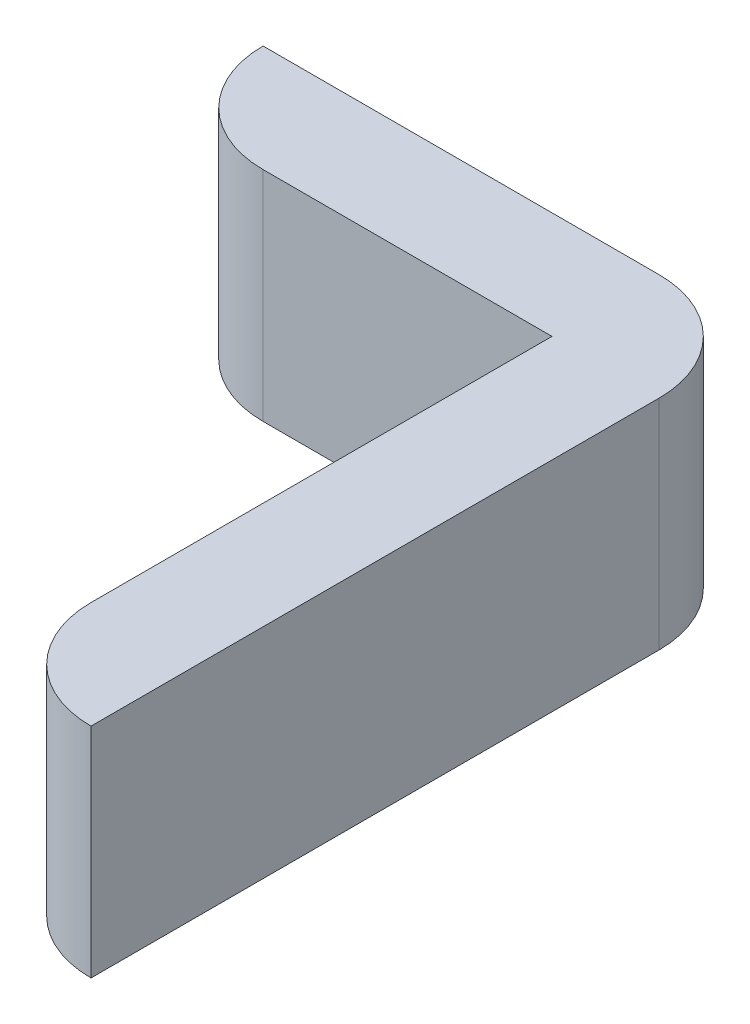
ISO-10303-21;
HEADER;
FILE_DESCRIPTION(('STEP AP214'),'2;1');
FILE_NAME('part.step','',(''),(''),'','','');
FILE_SCHEMA(('AUTOMOTIVE_DESIGN { 1 0 10303 214 1 1 1 1 }'));
ENDSEC;
DATA;
#1=APPLICATION_CONTEXT('core data for automotive mechanical design processes');
#2=APPLICATION_PROTOCOL_DEFINITION('international standard','automotive_design',2000,#1);
#3=PRODUCT_CONTEXT('',#1,'mechanical');
#4=PRODUCT('Part','Part','',(#3));
#5=PRODUCT_RELATED_PRODUCT_CATEGORY('part','',(#4));
#6=PRODUCT_DEFINITION_FORMATION('','',#4);
#7=PRODUCT_DEFINITION_CONTEXT('part definition',#1,'design');
#8=PRODUCT_DEFINITION('design','',#6,#7);
#9=PRODUCT_DEFINITION_SHAPE('','',#8);
#10=(LENGTH_UNIT() NAMED_UNIT(*) SI_UNIT(.MILLI.,.METRE.));
#11=(NAMED_UNIT(*) PLANE_ANGLE_UNIT() SI_UNIT($,.RADIAN.));
#12=(NAMED_UNIT(*) SI_UNIT($,.STERADIAN.) SOLID_ANGLE_UNIT());
#13=UNCERTAINTY_MEASURE_WITH_UNIT(LENGTH_MEASURE(1.E-05),#10,'distance_accuracy_value','');
#14=(GEOMETRIC_REPRESENTATION_CONTEXT(3) GLOBAL_UNCERTAINTY_ASSIGNED_CONTEXT((#13)) GLOBAL_UNIT_ASSIGNED_CONTEXT((#10,
#11,#12)) REPRESENTATION_CONTEXT('',''));
#15=CARTESIAN_POINT('',(0.,0.,0.));
#16=DIRECTION('',(0.,0.,1.));
#17=DIRECTION('',(1.,0.,0.));
#18=AXIS2_PLACEMENT_3D('',#15,#16,#17);
#19=CARTESIAN_POINT('',(-0.125,-3.5552,0.));
#20=DIRECTION('',(0.,-1.,0.));
#21=DIRECTION('',(0.,0.,-1.));
#22=AXIS2_PLACEMENT_3D('',#19,#20,#21);
#23=PLANE('',#22);
#24=DIRECTION('',(-1.,0.,0.));
#25=VECTOR('',#24,1.);
#26=CARTESIAN_POINT('',(0.125,-3.5552,0.25));
#27=LINE('',#26,#25);
#28=CARTESIAN_POINT('',(0.125,-3.5552,0.25));
#29=VERTEX_POINT('',#28);
#30=CARTESIAN_POINT('',(0.8,-3.5552,0.25));
#31=VERTEX_POINT('',#30);
#32=EDGE_CURVE('E102',#29,#31,#27,.F.);
#33=ORIENTED_EDGE('',*,*,#32,.T.);
#34=DIRECTION('',(0.,0.,-1.));
#35=VECTOR('',#34,1.);
#36=CARTESIAN_POINT('',(0.8,-3.5552,0.25));
#37=LINE('',#36,#35);
#38=CARTESIAN_POINT('',(0.8,-3.5552,1.327));
#39=VERTEX_POINT('',#38);
#40=EDGE_CURVE('E108',#31,#39,#37,.F.);
#41=ORIENTED_EDGE('',*,*,#40,.T.);
#42=CARTESIAN_POINT('',(1.05,-3.5552,1.327));
#43=DIRECTION('',(0.,-1.,0.));
#44=DIRECTION('',(0.,0.,-1.));
#45=AXIS2_PLACEMENT_3D('',#42,#43,#44);
#46=CIRCLE('',#45,0.25);
#47=CARTESIAN_POINT('',(1.05,-3.5552,1.577));
#48=VERTEX_POINT('',#47);
#49=EDGE_CURVE('E80',#48,#39,#46,.T.);
#50=ORIENTED_EDGE('',*,*,#49,.F.);
#51=DIRECTION('',(0.,0.,1.));
#52=VECTOR('',#51,1.);
#53=CARTESIAN_POINT('',(1.05,-3.5552,1.577));
#54=LINE('',#53,#52);
#55=CARTESIAN_POINT('',(1.05,-3.5552,0.25));
#56=VERTEX_POINT('',#55);
#57=EDGE_CURVE('E75',#48,#56,#54,.F.);
#58=ORIENTED_EDGE('',*,*,#57,.T.);
#59=CARTESIAN_POINT('',(0.8,-3.5552,0.25));
#60=DIRECTION('',(0.,-1.,0.));
#61=DIRECTION('',(0.,0.,-1.));
#62=AXIS2_PLACEMENT_3D('',#59,#60,#61);
#63=CIRCLE('',#62,0.25);
#64=CARTESIAN_POINT('',(0.8,-3.5552,0.));
#65=VERTEX_POINT('',#64);
#66=EDGE_CURVE('E19',#65,#56,#63,.T.);
#67=ORIENTED_EDGE('',*,*,#66,.F.);
#68=DIRECTION('',(1.,0.,0.));
#69=VECTOR('',#68,1.);
#70=CARTESIAN_POINT('',(0.8,-3.5552,0.));
#71=LINE('',#70,#69);
#72=CARTESIAN_POINT('',(-0.125,-3.5552,0.));
#73=VERTEX_POINT('',#72);
#74=EDGE_CURVE('E70',#65,#73,#71,.F.);
#75=ORIENTED_EDGE('',*,*,#74,.T.);
#76=CARTESIAN_POINT('',(0.125,-3.5552,0.));
#77=DIRECTION('',(0.,-1.,0.));
#78=DIRECTION('',(0.,0.,-1.));
#79=AXIS2_PLACEMENT_3D('',#76,#77,#78);
#80=CIRCLE('',#79,0.25);
#81=EDGE_CURVE('E121',#29,#73,#80,.T.);
#82=ORIENTED_EDGE('',*,*,#81,.F.);
#83=EDGE_LOOP('',(#33,#41,#50,#58,#67,#75,#82));
#84=FACE_BOUND('',#83,.T.);
#85=ADVANCED_FACE('F16',(#84),#23,.F.);
#86=CARTESIAN_POINT('',(0.8,-4.0648,0.));
#87=DIRECTION('',(0.,0.,1.));
#88=DIRECTION('',(1.,0.,0.));
#89=AXIS2_PLACEMENT_3D('',#86,#87,#88);
#90=PLANE('',#89);
#91=DIRECTION('',(0.,-1.,0.));
#92=VECTOR('',#91,1.);
#93=CARTESIAN_POINT('',(-0.125,-4.0648,0.));
#94=LINE('',#93,#92);
#95=CARTESIAN_POINT('',(-0.125,-4.0648,0.));
#96=VERTEX_POINT('',#95);
#97=EDGE_CURVE('E123',#73,#96,#94,.T.);
#98=ORIENTED_EDGE('',*,*,#97,.F.);
#99=ORIENTED_EDGE('',*,*,#74,.F.);
#100=DIRECTION('',(0.,-1.,0.));
#101=VECTOR('',#100,1.);
#102=CARTESIAN_POINT('',(0.8,-4.0648,0.));
#103=LINE('',#102,#101);
#104=CARTESIAN_POINT('',(0.8,-4.0648,0.));
#105=VERTEX_POINT('',#104);
#106=EDGE_CURVE('E92',#105,#65,#103,.F.);
#107=ORIENTED_EDGE('',*,*,#106,.F.);
#108=DIRECTION('',(1.,0.,0.));
#109=VECTOR('',#108,1.);
#110=CARTESIAN_POINT('',(-0.125,-4.0648,0.));
#111=LINE('',#110,#109);
#112=EDGE_CURVE('E120',#96,#105,#111,.T.);
#113=ORIENTED_EDGE('',*,*,#112,.F.);
#114=EDGE_LOOP('',(#98,#99,#107,#113));
#115=FACE_BOUND('',#114,.T.);
#116=ADVANCED_FACE('F158',(#115),#90,.F.);
#117=CARTESIAN_POINT('',(0.8,-4.0648,0.25));
#118=DIRECTION('',(0.,-1.,0.));
#119=DIRECTION('',(0.,0.,-1.));
#120=AXIS2_PLACEMENT_3D('',#117,#118,#119);
#121=CYLINDRICAL_SURFACE('',#120,0.25);
#122=ORIENTED_EDGE('',*,*,#66,.T.);
#123=DIRECTION('',(0.,1.,0.));
#124=VECTOR('',#123,1.);
#125=CARTESIAN_POINT('',(1.05,-4.0648,0.25));
#126=LINE('',#125,#124);
#127=CARTESIAN_POINT('',(1.05,-4.0648,0.25));
#128=VERTEX_POINT('',#127);
#129=EDGE_CURVE('E86',#56,#128,#126,.F.);
#130=ORIENTED_EDGE('',*,*,#129,.T.);
#131=CARTESIAN_POINT('',(0.8,-4.0648,0.25));
#132=DIRECTION('',(0.,-1.,0.));
#133=DIRECTION('',(0.,0.,-1.));
#134=AXIS2_PLACEMENT_3D('',#131,#132,#133);
#135=CIRCLE('',#134,0.25);
#136=EDGE_CURVE('E118',#105,#128,#135,.T.);
#137=ORIENTED_EDGE('',*,*,#136,.F.);
#138=ORIENTED_EDGE('',*,*,#106,.T.);
#139=EDGE_LOOP('',(#122,#130,#137,#138));
#140=FACE_BOUND('',#139,.T.);
#141=ADVANCED_FACE('F89',(#140),#121,.T.);
#142=CARTESIAN_POINT('',(1.05,-4.0648,1.577));
#143=DIRECTION('',(-1.,0.,0.));
#144=DIRECTION('',(0.,0.,1.));
#145=AXIS2_PLACEMENT_3D('',#142,#143,#144);
#146=PLANE('',#145);
#147=DIRECTION('',(0.,-1.,0.));
#148=VECTOR('',#147,1.);
#149=CARTESIAN_POINT('',(1.05,-4.0648,1.577));
#150=LINE('',#149,#148);
#151=CARTESIAN_POINT('',(1.05,-4.0648,1.577));
#152=VERTEX_POINT('',#151);
#153=EDGE_CURVE('E85',#152,#48,#150,.F.);
#154=ORIENTED_EDGE('',*,*,#153,.F.);
#155=DIRECTION('',(0.,0.,-1.));
#156=VECTOR('',#155,1.);
#157=CARTESIAN_POINT('',(1.05,-4.0648,0.));
#158=LINE('',#157,#156);
#159=EDGE_CURVE('E94',#128,#152,#158,.F.);
#160=ORIENTED_EDGE('',*,*,#159,.F.);
#161=ORIENTED_EDGE('',*,*,#129,.F.);
#162=ORIENTED_EDGE('',*,*,#57,.F.);
#163=EDGE_LOOP('',(#154,#160,#161,#162));
#164=FACE_BOUND('',#163,.T.);
#165=ADVANCED_FACE('F93',(#164),#146,.F.);
#166=CARTESIAN_POINT('',(1.05,-4.0648,1.327));
#167=DIRECTION('',(0.,-1.,0.));
#168=DIRECTION('',(0.,0.,-1.));
#169=AXIS2_PLACEMENT_3D('',#166,#167,#168);
#170=CYLINDRICAL_SURFACE('',#169,0.25);
#171=ORIENTED_EDGE('',*,*,#49,.T.);
#172=DIRECTION('',(0.,1.,0.));
#173=VECTOR('',#172,1.);
#174=CARTESIAN_POINT('',(0.8,-4.0648,1.327));
#175=LINE('',#174,#173);
#176=CARTESIAN_POINT('',(0.8,-4.0648,1.327));
#177=VERTEX_POINT('',#176);
#178=EDGE_CURVE('E105',#39,#177,#175,.F.);
#179=ORIENTED_EDGE('',*,*,#178,.T.);
#180=CARTESIAN_POINT('',(1.05,-4.0648,1.327));
#181=DIRECTION('',(0.,-1.,0.));
#182=DIRECTION('',(0.,0.,-1.));
#183=AXIS2_PLACEMENT_3D('',#180,#181,#182);
#184=CIRCLE('',#183,0.25);
#185=EDGE_CURVE('E114',#152,#177,#184,.T.);
#186=ORIENTED_EDGE('',*,*,#185,.F.);
#187=ORIENTED_EDGE('',*,*,#153,.T.);
#188=EDGE_LOOP('',(#171,#179,#186,#187));
#189=FACE_BOUND('',#188,.T.);
#190=ADVANCED_FACE('F127',(#189),#170,.T.);
#191=CARTESIAN_POINT('',(0.8,-4.0648,0.25));
#192=DIRECTION('',(1.,0.,0.));
#193=DIRECTION('',(0.,0.,-1.));
#194=AXIS2_PLACEMENT_3D('',#191,#192,#193);
#195=PLANE('',#194);
#196=ORIENTED_EDGE('',*,*,#178,.F.);
#197=ORIENTED_EDGE('',*,*,#40,.F.);
#198=DIRECTION('',(0.,1.,0.));
#199=VECTOR('',#198,1.);
#200=CARTESIAN_POINT('',(0.8,-4.0648,0.25));
#201=LINE('',#200,#199);
#202=CARTESIAN_POINT('',(0.8,-4.0648,0.25));
#203=VERTEX_POINT('',#202);
#204=EDGE_CURVE('E104',#31,#203,#201,.F.);
#205=ORIENTED_EDGE('',*,*,#204,.T.);
#206=DIRECTION('',(0.,0.,-1.));
#207=VECTOR('',#206,1.);
#208=CARTESIAN_POINT('',(0.8,-4.0648,0.));
#209=LINE('',#208,#207);
#210=EDGE_CURVE('E117',#177,#203,#209,.T.);
#211=ORIENTED_EDGE('',*,*,#210,.F.);
#212=EDGE_LOOP('',(#196,#197,#205,#211));
#213=FACE_BOUND('',#212,.T.);
#214=ADVANCED_FACE('F150',(#213),#195,.F.);
#215=CARTESIAN_POINT('',(0.125,-4.0648,0.25));
#216=DIRECTION('',(0.,0.,-1.));
#217=DIRECTION('',(-1.,0.,0.));
#218=AXIS2_PLACEMENT_3D('',#215,#216,#217);
#219=PLANE('',#218);
#220=ORIENTED_EDGE('',*,*,#204,.F.);
#221=ORIENTED_EDGE('',*,*,#32,.F.);
#222=DIRECTION('',(0.,-1.,0.));
#223=VECTOR('',#222,1.);
#224=CARTESIAN_POINT('',(0.125,-4.0648,0.25));
#225=LINE('',#224,#223);
#226=CARTESIAN_POINT('',(0.125,-4.0648,0.25));
#227=VERTEX_POINT('',#226);
#228=EDGE_CURVE('E34',#227,#29,#225,.F.);
#229=ORIENTED_EDGE('',*,*,#228,.F.);
#230=DIRECTION('',(1.,0.,0.));
#231=VECTOR('',#230,1.);
#232=CARTESIAN_POINT('',(-0.125,-4.0648,0.25));
#233=LINE('',#232,#231);
#234=EDGE_CURVE('E25',#203,#227,#233,.F.);
#235=ORIENTED_EDGE('',*,*,#234,.F.);
#236=EDGE_LOOP('',(#220,#221,#229,#235));
#237=FACE_BOUND('',#236,.T.);
#238=ADVANCED_FACE('F151',(#237),#219,.F.);
#239=CARTESIAN_POINT('',(0.125,-4.0648,0.));
#240=DIRECTION('',(0.,-1.,0.));
#241=DIRECTION('',(0.,0.,-1.));
#242=AXIS2_PLACEMENT_3D('',#239,#240,#241);
#243=CYLINDRICAL_SURFACE('',#242,0.25);
#244=ORIENTED_EDGE('',*,*,#81,.T.);
#245=ORIENTED_EDGE('',*,*,#97,.T.);
#246=CARTESIAN_POINT('',(0.125,-4.0648,0.));
#247=DIRECTION('',(0.,-1.,0.));
#248=DIRECTION('',(0.,0.,-1.));
#249=AXIS2_PLACEMENT_3D('',#246,#247,#248);
#250=CIRCLE('',#249,0.25);
#251=EDGE_CURVE('E11',#227,#96,#250,.T.);
#252=ORIENTED_EDGE('',*,*,#251,.F.);
#253=ORIENTED_EDGE('',*,*,#228,.T.);
#254=EDGE_LOOP('',(#244,#245,#252,#253));
#255=FACE_BOUND('',#254,.T.);
#256=ADVANCED_FACE('F156',(#255),#243,.T.);
#257=CARTESIAN_POINT('',(-0.125,-4.0648,0.));
#258=DIRECTION('',(0.,-1.,0.));
#259=DIRECTION('',(0.,0.,-1.));
#260=AXIS2_PLACEMENT_3D('',#257,#258,#259);
#261=PLANE('',#260);
#262=ORIENTED_EDGE('',*,*,#234,.T.);
#263=ORIENTED_EDGE('',*,*,#251,.T.);
#264=ORIENTED_EDGE('',*,*,#112,.T.);
#265=ORIENTED_EDGE('',*,*,#136,.T.);
#266=ORIENTED_EDGE('',*,*,#159,.T.);
#267=ORIENTED_EDGE('',*,*,#185,.T.);
#268=ORIENTED_EDGE('',*,*,#210,.T.);
#269=EDGE_LOOP('',(#262,#263,#264,#265,#266,#267,#268));
#270=FACE_BOUND('',#269,.T.);
#271=ADVANCED_FACE('F132',(#270),#261,.T.);
#272=CLOSED_SHELL('',(#85,#116,#141,#165,#190,#214,#238,#256,#271));
#273=MANIFOLD_SOLID_BREP('B1',#272);
#274=ADVANCED_BREP_SHAPE_REPRESENTATION('',(#18,#273),#14);
#275=SHAPE_DEFINITION_REPRESENTATION(#9,#274);
ENDSEC;
END-ISO-10303-21;
